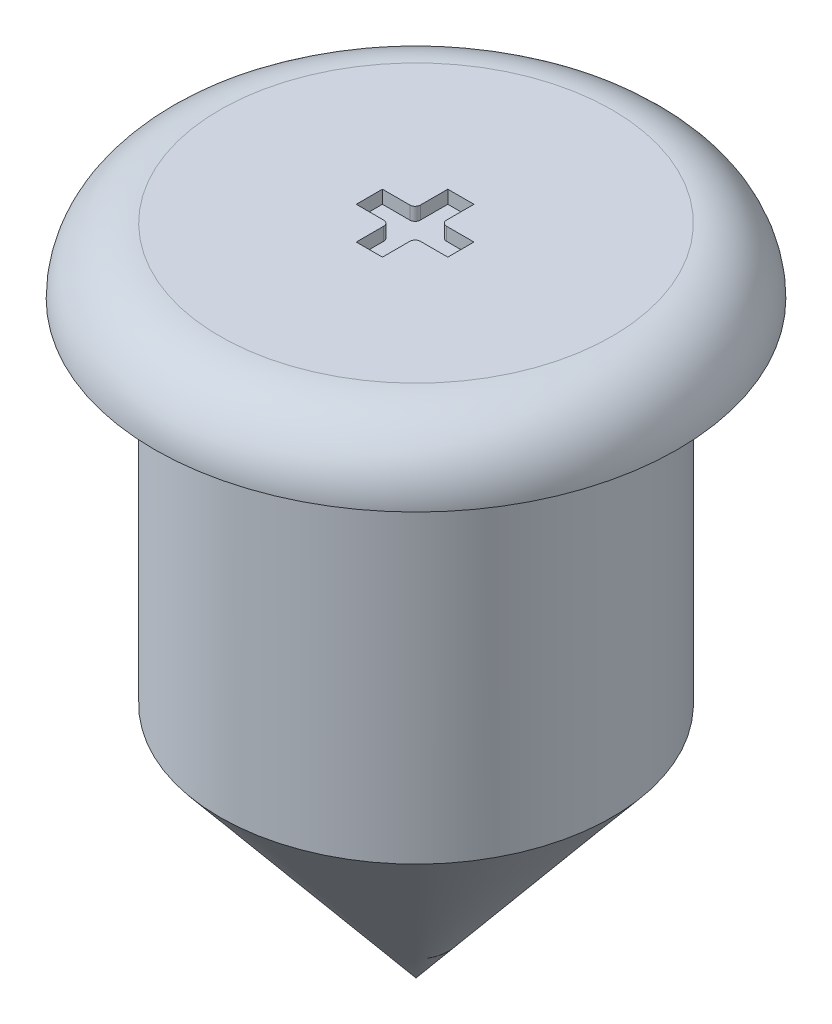
ISO-10303-21;
HEADER;
FILE_DESCRIPTION(('STEP AP214'),'2;1');
FILE_NAME('part.step','',(''),(''),'','','');
FILE_SCHEMA(('AUTOMOTIVE_DESIGN { 1 0 10303 214 1 1 1 1 }'));
ENDSEC;
DATA;
#1=APPLICATION_CONTEXT('core data for automotive mechanical design processes');
#2=APPLICATION_PROTOCOL_DEFINITION('international standard','automotive_design',2000,#1);
#3=PRODUCT_CONTEXT('',#1,'mechanical');
#4=PRODUCT('Part','Part','',(#3));
#5=PRODUCT_RELATED_PRODUCT_CATEGORY('part','',(#4));
#6=PRODUCT_DEFINITION_FORMATION('','',#4);
#7=PRODUCT_DEFINITION_CONTEXT('part definition',#1,'design');
#8=PRODUCT_DEFINITION('design','',#6,#7);
#9=PRODUCT_DEFINITION_SHAPE('','',#8);
#10=(LENGTH_UNIT() NAMED_UNIT(*) SI_UNIT(.MILLI.,.METRE.));
#11=(NAMED_UNIT(*) PLANE_ANGLE_UNIT() SI_UNIT($,.RADIAN.));
#12=(NAMED_UNIT(*) SI_UNIT($,.STERADIAN.) SOLID_ANGLE_UNIT());
#13=UNCERTAINTY_MEASURE_WITH_UNIT(LENGTH_MEASURE(1.E-05),#10,'distance_accuracy_value','');
#14=(GEOMETRIC_REPRESENTATION_CONTEXT(3) GLOBAL_UNCERTAINTY_ASSIGNED_CONTEXT((#13)) GLOBAL_UNIT_ASSIGNED_CONTEXT((#10,
#11,#12)) REPRESENTATION_CONTEXT('',''));
#15=CARTESIAN_POINT('',(0.,0.,0.));
#16=DIRECTION('',(0.,0.,1.));
#17=DIRECTION('',(1.,0.,0.));
#18=AXIS2_PLACEMENT_3D('',#15,#16,#17);
#19=CARTESIAN_POINT('',(0.,-33.8273670127026,0.));
#20=DIRECTION('',(0.,1.,0.));
#21=DIRECTION('',(0.,0.,1.));
#22=AXIS2_PLACEMENT_3D('',#19,#20,#21);
#23=CONICAL_SURFACE('',#22,0.,0.690836574437908);
#24=CARTESIAN_POINT('',(0.,-32.0130195359699,0.));
#25=DIRECTION('',(0.,-1.,0.));
#26=DIRECTION('',(0.,0.,-1.));
#27=AXIS2_PLACEMENT_3D('',#24,#25,#26);
#28=CIRCLE('',#27,1.5);
#29=CARTESIAN_POINT('',(0.,-32.0130195359699,-1.5));
#30=VERTEX_POINT('',#29);
#31=EDGE_CURVE('E11',#30,#30,#28,.T.);
#32=ORIENTED_EDGE('',*,*,#31,.T.);
#33=EDGE_LOOP('',(#32));
#34=FACE_BOUND('',#33,.T.);
#35=CARTESIAN_POINT('',(0.,-33.8273670127026,0.));
#36=VERTEX_POINT('',#35);
#37=VERTEX_LOOP('',#36);
#38=FACE_BOUND('',#37,.T.);
#39=ADVANCED_FACE('F45',(#34,#38),#23,.T.);
#40=CARTESIAN_POINT('',(0.,-33.8273670127026,0.));
#41=DIRECTION('',(0.,-1.,0.));
#42=DIRECTION('',(0.,0.,-1.));
#43=AXIS2_PLACEMENT_3D('',#40,#41,#42);
#44=CYLINDRICAL_SURFACE('',#43,1.5);
#45=CARTESIAN_POINT('',(0.,-29.3273670127026,0.));
#46=DIRECTION('',(0.,-1.,0.));
#47=DIRECTION('',(0.,0.,-1.));
#48=AXIS2_PLACEMENT_3D('',#45,#46,#47);
#49=CIRCLE('',#48,1.5);
#50=CARTESIAN_POINT('',(0.,-29.3273670127026,-1.5));
#51=VERTEX_POINT('',#50);
#52=EDGE_CURVE('E52',#51,#51,#49,.T.);
#53=ORIENTED_EDGE('',*,*,#52,.T.);
#54=EDGE_LOOP('',(#53));
#55=FACE_BOUND('',#54,.T.);
#56=ORIENTED_EDGE('',*,*,#31,.F.);
#57=EDGE_LOOP('',(#56));
#58=FACE_BOUND('',#57,.T.);
#59=ADVANCED_FACE('F299',(#55,#58),#44,.T.);
#60=CARTESIAN_POINT('',(1.5,-29.3273670127026,0.));
#61=DIRECTION('',(0.,-1.,0.));
#62=DIRECTION('',(0.,0.,-1.));
#63=AXIS2_PLACEMENT_3D('',#60,#61,#62);
#64=PLANE('',#63);
#65=CARTESIAN_POINT('',(0.,-29.3273670127026,0.));
#66=DIRECTION('',(0.,-1.,0.));
#67=DIRECTION('',(0.,0.,-1.));
#68=AXIS2_PLACEMENT_3D('',#65,#66,#67);
#69=CIRCLE('',#68,2.);
#70=CARTESIAN_POINT('',(0.,-29.3273670127026,-2.));
#71=VERTEX_POINT('',#70);
#72=EDGE_CURVE('E294',#71,#71,#69,.T.);
#73=ORIENTED_EDGE('',*,*,#72,.T.);
#74=EDGE_LOOP('',(#73));
#75=FACE_BOUND('',#74,.T.);
#76=ORIENTED_EDGE('',*,*,#52,.F.);
#77=EDGE_LOOP('',(#76));
#78=FACE_BOUND('',#77,.T.);
#79=ADVANCED_FACE('F302',(#75,#78),#64,.T.);
#80=CARTESIAN_POINT('',(0.,-29.3273670127026,0.));
#81=DIRECTION('',(0.,-1.,0.));
#82=DIRECTION('',(0.,0.,-1.));
#83=AXIS2_PLACEMENT_3D('',#80,#81,#82);
#84=TOROIDAL_SURFACE('',#83,1.5,0.5);
#85=CARTESIAN_POINT('',(0.,-28.8273670127026,0.));
#86=DIRECTION('',(0.,-1.,0.));
#87=DIRECTION('',(0.,0.,-1.));
#88=AXIS2_PLACEMENT_3D('',#85,#86,#87);
#89=CIRCLE('',#88,1.5);
#90=CARTESIAN_POINT('',(0.,-28.8273670127026,-1.5));
#91=VERTEX_POINT('',#90);
#92=EDGE_CURVE('E264',#91,#91,#89,.T.);
#93=ORIENTED_EDGE('',*,*,#92,.T.);
#94=EDGE_LOOP('',(#93));
#95=FACE_BOUND('',#94,.T.);
#96=ORIENTED_EDGE('',*,*,#72,.F.);
#97=EDGE_LOOP('',(#96));
#98=FACE_BOUND('',#97,.T.);
#99=ADVANCED_FACE('F304',(#95,#98),#84,.T.);
#100=CARTESIAN_POINT('',(1.5,-28.8273670127026,0.));
#101=DIRECTION('',(0.,1.,0.));
#102=DIRECTION('',(0.,0.,1.));
#103=AXIS2_PLACEMENT_3D('',#100,#101,#102);
#104=PLANE('',#103);
#105=DIRECTION('',(0.,0.,-1.));
#106=VECTOR('',#105,1.);
#107=CARTESIAN_POINT('',(0.097259553132017,-28.8273670127026,-0.345923697626217));
#108=LINE('',#107,#106);
#109=CARTESIAN_POINT('',(0.097259553132017,-28.8273670127026,-0.135923697626217));
#110=VERTEX_POINT('',#109);
#111=CARTESIAN_POINT('',(0.0972595531320171,-28.8273670127026,-0.345923697626217));
#112=VERTEX_POINT('',#111);
#113=EDGE_CURVE('E59',#110,#112,#108,.T.);
#114=ORIENTED_EDGE('',*,*,#113,.F.);
#115=CARTESIAN_POINT('',(0.137259553132017,-28.8273670127026,-0.135923697626217));
#116=DIRECTION('',(0.,-1.,0.));
#117=DIRECTION('',(0.,0.,1.));
#118=AXIS2_PLACEMENT_3D('',#115,#116,#117);
#119=CIRCLE('',#118,0.04);
#120=CARTESIAN_POINT('',(0.137259553132017,-28.8273670127026,-0.0959236976262174));
#121=VERTEX_POINT('',#120);
#122=EDGE_CURVE('E178',#121,#110,#119,.T.);
#123=ORIENTED_EDGE('',*,*,#122,.F.);
#124=DIRECTION('',(-1.,0.,0.));
#125=VECTOR('',#124,1.);
#126=CARTESIAN_POINT('',(0.137259553132017,-28.8273670127026,-0.0959236976262174));
#127=LINE('',#126,#125);
#128=CARTESIAN_POINT('',(0.347259553132017,-28.8273670127026,-0.0959236976262174));
#129=VERTEX_POINT('',#128);
#130=EDGE_CURVE('E181',#129,#121,#127,.T.);
#131=ORIENTED_EDGE('',*,*,#130,.F.);
#132=DIRECTION('',(0.,0.,-1.));
#133=VECTOR('',#132,1.);
#134=CARTESIAN_POINT('',(0.347259553132017,-28.8273670127026,-0.0959236976262174));
#135=LINE('',#134,#133);
#136=CARTESIAN_POINT('',(0.347259553132017,-28.8273670127026,0.104076302373783));
#137=VERTEX_POINT('',#136);
#138=EDGE_CURVE('E257',#137,#129,#135,.T.);
#139=ORIENTED_EDGE('',*,*,#138,.F.);
#140=DIRECTION('',(1.,0.,0.));
#141=VECTOR('',#140,1.);
#142=CARTESIAN_POINT('',(0.347259553132017,-28.8273670127026,0.104076302373783));
#143=LINE('',#142,#141);
#144=CARTESIAN_POINT('',(0.137259553132017,-28.8273670127026,0.104076302373783));
#145=VERTEX_POINT('',#144);
#146=EDGE_CURVE('E254',#145,#137,#143,.T.);
#147=ORIENTED_EDGE('',*,*,#146,.F.);
#148=CARTESIAN_POINT('',(0.137259553132017,-28.8273670127026,0.144076302373783));
#149=DIRECTION('',(0.,-1.,0.));
#150=DIRECTION('',(0.,0.,1.));
#151=AXIS2_PLACEMENT_3D('',#148,#149,#150);
#152=CIRCLE('',#151,0.04);
#153=CARTESIAN_POINT('',(0.097259553132017,-28.8273670127026,0.144076302373783));
#154=VERTEX_POINT('',#153);
#155=EDGE_CURVE('E251',#154,#145,#152,.T.);
#156=ORIENTED_EDGE('',*,*,#155,.F.);
#157=DIRECTION('',(0.,0.,-1.));
#158=VECTOR('',#157,1.);
#159=CARTESIAN_POINT('',(0.097259553132017,-28.8273670127026,0.144076302373783));
#160=LINE('',#159,#158);
#161=CARTESIAN_POINT('',(0.097259553132017,-28.8273670127026,0.354076302373785));
#162=VERTEX_POINT('',#161);
#163=EDGE_CURVE('E248',#162,#154,#160,.T.);
#164=ORIENTED_EDGE('',*,*,#163,.F.);
#165=DIRECTION('',(1.,0.,0.));
#166=VECTOR('',#165,1.);
#167=CARTESIAN_POINT('',(0.097259553132017,-28.8273670127026,0.354076302373785));
#168=LINE('',#167,#166);
#169=CARTESIAN_POINT('',(-0.102740446867983,-28.8273670127026,0.354076302373785));
#170=VERTEX_POINT('',#169);
#171=EDGE_CURVE('E245',#170,#162,#168,.T.);
#172=ORIENTED_EDGE('',*,*,#171,.F.);
#173=DIRECTION('',(0.,0.,1.));
#174=VECTOR('',#173,1.);
#175=CARTESIAN_POINT('',(-0.102740446867983,-28.8273670127026,0.144076302373783));
#176=LINE('',#175,#174);
#177=CARTESIAN_POINT('',(-0.102740446867983,-28.8273670127026,0.144076302373783));
#178=VERTEX_POINT('',#177);
#179=EDGE_CURVE('E242',#178,#170,#176,.T.);
#180=ORIENTED_EDGE('',*,*,#179,.F.);
#181=CARTESIAN_POINT('',(-0.142740446867983,-28.8273670127026,0.144076302373783));
#182=DIRECTION('',(0.,-1.,0.));
#183=DIRECTION('',(0.,0.,-1.));
#184=AXIS2_PLACEMENT_3D('',#181,#182,#183);
#185=CIRCLE('',#184,0.04);
#186=CARTESIAN_POINT('',(-0.142740446867983,-28.8273670127026,0.104076302373783));
#187=VERTEX_POINT('',#186);
#188=EDGE_CURVE('E239',#187,#178,#185,.T.);
#189=ORIENTED_EDGE('',*,*,#188,.F.);
#190=DIRECTION('',(1.,0.,0.));
#191=VECTOR('',#190,1.);
#192=CARTESIAN_POINT('',(-0.352740446867983,-28.8273670127026,0.104076302373783));
#193=LINE('',#192,#191);
#194=CARTESIAN_POINT('',(-0.352740446867983,-28.8273670127026,0.104076302373783));
#195=VERTEX_POINT('',#194);
#196=EDGE_CURVE('E236',#195,#187,#193,.T.);
#197=ORIENTED_EDGE('',*,*,#196,.F.);
#198=DIRECTION('',(0.,0.,1.));
#199=VECTOR('',#198,1.);
#200=CARTESIAN_POINT('',(-0.352740446867983,-28.8273670127026,-0.0959236976262174));
#201=LINE('',#200,#199);
#202=CARTESIAN_POINT('',(-0.352740446867983,-28.8273670127026,-0.0959236976262174));
#203=VERTEX_POINT('',#202);
#204=EDGE_CURVE('E233',#203,#195,#201,.T.);
#205=ORIENTED_EDGE('',*,*,#204,.F.);
#206=DIRECTION('',(-1.,0.,0.));
#207=VECTOR('',#206,1.);
#208=CARTESIAN_POINT('',(-0.142740446867983,-28.8273670127026,-0.0959236976262174));
#209=LINE('',#208,#207);
#210=CARTESIAN_POINT('',(-0.142740446867983,-28.8273670127026,-0.0959236976262174));
#211=VERTEX_POINT('',#210);
#212=EDGE_CURVE('E230',#211,#203,#209,.T.);
#213=ORIENTED_EDGE('',*,*,#212,.F.);
#214=CARTESIAN_POINT('',(-0.142740446867983,-28.8273670127026,-0.135923697626217));
#215=DIRECTION('',(0.,-1.,0.));
#216=DIRECTION('',(0.,0.,-1.));
#217=AXIS2_PLACEMENT_3D('',#214,#215,#216);
#218=CIRCLE('',#217,0.04);
#219=CARTESIAN_POINT('',(-0.102740446867983,-28.8273670127026,-0.135923697626217));
#220=VERTEX_POINT('',#219);
#221=EDGE_CURVE('E227',#220,#211,#218,.T.);
#222=ORIENTED_EDGE('',*,*,#221,.F.);
#223=DIRECTION('',(0.,0.,1.));
#224=VECTOR('',#223,1.);
#225=CARTESIAN_POINT('',(-0.102740446867983,-28.8273670127026,-0.345923697626217));
#226=LINE('',#225,#224);
#227=CARTESIAN_POINT('',(-0.102740446867983,-28.8273670127026,-0.345923697626217));
#228=VERTEX_POINT('',#227);
#229=EDGE_CURVE('E224',#228,#220,#226,.T.);
#230=ORIENTED_EDGE('',*,*,#229,.F.);
#231=DIRECTION('',(-1.,0.,0.));
#232=VECTOR('',#231,1.);
#233=CARTESIAN_POINT('',(-0.102740446867983,-28.8273670127026,-0.345923697626217));
#234=LINE('',#233,#232);
#235=EDGE_CURVE('E222',#112,#228,#234,.T.);
#236=ORIENTED_EDGE('',*,*,#235,.F.);
#237=EDGE_LOOP('',(#114,#123,#131,#139,#147,#156,#164,#172,#180,#189,#197,#205,#213,#222,#230,#236));
#238=FACE_BOUND('',#237,.T.);
#239=ORIENTED_EDGE('',*,*,#92,.F.);
#240=EDGE_LOOP('',(#239));
#241=FACE_BOUND('',#240,.T.);
#242=ADVANCED_FACE('F311',(#238,#241),#104,.T.);
#243=CARTESIAN_POINT('',(0.097259553132017,-28.9273670127026,-0.345923697626217));
#244=DIRECTION('',(1.,0.,0.));
#245=DIRECTION('',(0.,0.,-1.));
#246=AXIS2_PLACEMENT_3D('',#243,#244,#245);
#247=PLANE('',#246);
#248=ORIENTED_EDGE('',*,*,#113,.T.);
#249=DIRECTION('',(0.,1.,0.));
#250=VECTOR('',#249,1.);
#251=CARTESIAN_POINT('',(0.097259553132017,-28.9273670127026,-0.345923697626217));
#252=LINE('',#251,#250);
#253=CARTESIAN_POINT('',(0.097259553132017,-28.9273670127026,-0.345923697626217));
#254=VERTEX_POINT('',#253);
#255=EDGE_CURVE('E155',#254,#112,#252,.T.);
#256=ORIENTED_EDGE('',*,*,#255,.F.);
#257=DIRECTION('',(0.,0.,-1.));
#258=VECTOR('',#257,1.);
#259=CARTESIAN_POINT('',(0.097259553132017,-28.9273670127026,-0.345923697626217));
#260=LINE('',#259,#258);
#261=CARTESIAN_POINT('',(0.097259553132017,-28.9273670127026,-0.135923697626217));
#262=VERTEX_POINT('',#261);
#263=EDGE_CURVE('E159',#262,#254,#260,.T.);
#264=ORIENTED_EDGE('',*,*,#263,.F.);
#265=DIRECTION('',(0.,1.,0.));
#266=VECTOR('',#265,1.);
#267=CARTESIAN_POINT('',(0.097259553132017,-28.9273670127026,-0.135923697626217));
#268=LINE('',#267,#266);
#269=EDGE_CURVE('E262',#262,#110,#268,.T.);
#270=ORIENTED_EDGE('',*,*,#269,.T.);
#271=EDGE_LOOP('',(#248,#256,#264,#270));
#272=FACE_BOUND('',#271,.T.);
#273=ADVANCED_FACE('F157',(#272),#247,.F.);
#274=CARTESIAN_POINT('',(0.137259553132017,-28.9273670127026,-0.135923697626217));
#275=DIRECTION('',(0.,1.,0.));
#276=DIRECTION('',(0.,0.,1.));
#277=AXIS2_PLACEMENT_3D('',#274,#275,#276);
#278=CYLINDRICAL_SURFACE('',#277,0.04);
#279=ORIENTED_EDGE('',*,*,#122,.T.);
#280=ORIENTED_EDGE('',*,*,#269,.F.);
#281=CARTESIAN_POINT('',(0.137259553132017,-28.9273670127026,-0.135923697626217));
#282=DIRECTION('',(0.,-1.,0.));
#283=DIRECTION('',(0.,0.,1.));
#284=AXIS2_PLACEMENT_3D('',#281,#282,#283);
#285=CIRCLE('',#284,0.04);
#286=CARTESIAN_POINT('',(0.137259553132017,-28.9273670127026,-0.0959236976262174));
#287=VERTEX_POINT('',#286);
#288=EDGE_CURVE('E165',#287,#262,#285,.T.);
#289=ORIENTED_EDGE('',*,*,#288,.F.);
#290=DIRECTION('',(0.,1.,0.));
#291=VECTOR('',#290,1.);
#292=CARTESIAN_POINT('',(0.137259553132017,-28.9273670127026,-0.0959236976262174));
#293=LINE('',#292,#291);
#294=EDGE_CURVE('E265',#287,#121,#293,.T.);
#295=ORIENTED_EDGE('',*,*,#294,.T.);
#296=EDGE_LOOP('',(#279,#280,#289,#295));
#297=FACE_BOUND('',#296,.T.);
#298=ADVANCED_FACE('F363',(#297),#278,.T.);
#299=CARTESIAN_POINT('',(0.137259553132017,-28.9273670127026,-0.0959236976262174));
#300=DIRECTION('',(0.,0.,-1.));
#301=DIRECTION('',(-1.,0.,0.));
#302=AXIS2_PLACEMENT_3D('',#299,#300,#301);
#303=PLANE('',#302);
#304=ORIENTED_EDGE('',*,*,#130,.T.);
#305=ORIENTED_EDGE('',*,*,#294,.F.);
#306=DIRECTION('',(-1.,0.,0.));
#307=VECTOR('',#306,1.);
#308=CARTESIAN_POINT('',(0.137259553132017,-28.9273670127026,-0.0959236976262174));
#309=LINE('',#308,#307);
#310=CARTESIAN_POINT('',(0.347259553132017,-28.9273670127026,-0.0959236976262174));
#311=VERTEX_POINT('',#310);
#312=EDGE_CURVE('E218',#311,#287,#309,.T.);
#313=ORIENTED_EDGE('',*,*,#312,.F.);
#314=DIRECTION('',(0.,1.,0.));
#315=VECTOR('',#314,1.);
#316=CARTESIAN_POINT('',(0.347259553132017,-28.9273670127026,-0.0959236976262174));
#317=LINE('',#316,#315);
#318=EDGE_CURVE('E267',#311,#129,#317,.T.);
#319=ORIENTED_EDGE('',*,*,#318,.T.);
#320=EDGE_LOOP('',(#304,#305,#313,#319));
#321=FACE_BOUND('',#320,.T.);
#322=ADVANCED_FACE('F373',(#321),#303,.F.);
#323=CARTESIAN_POINT('',(0.347259553132017,-28.9273670127026,-0.0959236976262174));
#324=DIRECTION('',(1.,0.,0.));
#325=DIRECTION('',(0.,0.,-1.));
#326=AXIS2_PLACEMENT_3D('',#323,#324,#325);
#327=PLANE('',#326);
#328=ORIENTED_EDGE('',*,*,#138,.T.);
#329=ORIENTED_EDGE('',*,*,#318,.F.);
#330=DIRECTION('',(0.,0.,-1.));
#331=VECTOR('',#330,1.);
#332=CARTESIAN_POINT('',(0.347259553132017,-28.9273670127026,-0.0959236976262174));
#333=LINE('',#332,#331);
#334=CARTESIAN_POINT('',(0.347259553132017,-28.9273670127026,0.104076302373783));
#335=VERTEX_POINT('',#334);
#336=EDGE_CURVE('E215',#335,#311,#333,.T.);
#337=ORIENTED_EDGE('',*,*,#336,.F.);
#338=DIRECTION('',(0.,1.,0.));
#339=VECTOR('',#338,1.);
#340=CARTESIAN_POINT('',(0.347259553132017,-28.9273670127026,0.104076302373783));
#341=LINE('',#340,#339);
#342=EDGE_CURVE('E269',#335,#137,#341,.T.);
#343=ORIENTED_EDGE('',*,*,#342,.T.);
#344=EDGE_LOOP('',(#328,#329,#337,#343));
#345=FACE_BOUND('',#344,.T.);
#346=ADVANCED_FACE('F384',(#345),#327,.F.);
#347=CARTESIAN_POINT('',(0.347259553132017,-28.9273670127026,0.104076302373783));
#348=DIRECTION('',(0.,0.,1.));
#349=DIRECTION('',(1.,0.,0.));
#350=AXIS2_PLACEMENT_3D('',#347,#348,#349);
#351=PLANE('',#350);
#352=ORIENTED_EDGE('',*,*,#146,.T.);
#353=ORIENTED_EDGE('',*,*,#342,.F.);
#354=DIRECTION('',(1.,0.,0.));
#355=VECTOR('',#354,1.);
#356=CARTESIAN_POINT('',(0.347259553132017,-28.9273670127026,0.104076302373783));
#357=LINE('',#356,#355);
#358=CARTESIAN_POINT('',(0.137259553132017,-28.9273670127026,0.104076302373783));
#359=VERTEX_POINT('',#358);
#360=EDGE_CURVE('E212',#359,#335,#357,.T.);
#361=ORIENTED_EDGE('',*,*,#360,.F.);
#362=DIRECTION('',(0.,1.,0.));
#363=VECTOR('',#362,1.);
#364=CARTESIAN_POINT('',(0.137259553132017,-28.9273670127026,0.104076302373783));
#365=LINE('',#364,#363);
#366=EDGE_CURVE('E271',#359,#145,#365,.T.);
#367=ORIENTED_EDGE('',*,*,#366,.T.);
#368=EDGE_LOOP('',(#352,#353,#361,#367));
#369=FACE_BOUND('',#368,.T.);
#370=ADVANCED_FACE('F395',(#369),#351,.F.);
#371=CARTESIAN_POINT('',(0.137259553132017,-28.9273670127026,0.144076302373783));
#372=DIRECTION('',(0.,1.,0.));
#373=DIRECTION('',(0.,0.,1.));
#374=AXIS2_PLACEMENT_3D('',#371,#372,#373);
#375=CYLINDRICAL_SURFACE('',#374,0.04);
#376=ORIENTED_EDGE('',*,*,#155,.T.);
#377=ORIENTED_EDGE('',*,*,#366,.F.);
#378=CARTESIAN_POINT('',(0.137259553132017,-28.9273670127026,0.144076302373783));
#379=DIRECTION('',(0.,-1.,0.));
#380=DIRECTION('',(0.,0.,1.));
#381=AXIS2_PLACEMENT_3D('',#378,#379,#380);
#382=CIRCLE('',#381,0.04);
#383=CARTESIAN_POINT('',(0.097259553132017,-28.9273670127026,0.144076302373783));
#384=VERTEX_POINT('',#383);
#385=EDGE_CURVE('E209',#384,#359,#382,.T.);
#386=ORIENTED_EDGE('',*,*,#385,.F.);
#387=DIRECTION('',(0.,1.,0.));
#388=VECTOR('',#387,1.);
#389=CARTESIAN_POINT('',(0.097259553132017,-28.9273670127026,0.144076302373783));
#390=LINE('',#389,#388);
#391=EDGE_CURVE('E273',#384,#154,#390,.T.);
#392=ORIENTED_EDGE('',*,*,#391,.T.);
#393=EDGE_LOOP('',(#376,#377,#386,#392));
#394=FACE_BOUND('',#393,.T.);
#395=ADVANCED_FACE('F406',(#394),#375,.T.);
#396=CARTESIAN_POINT('',(0.097259553132017,-28.9273670127026,0.144076302373783));
#397=DIRECTION('',(1.,0.,0.));
#398=DIRECTION('',(0.,0.,-1.));
#399=AXIS2_PLACEMENT_3D('',#396,#397,#398);
#400=PLANE('',#399);
#401=ORIENTED_EDGE('',*,*,#163,.T.);
#402=ORIENTED_EDGE('',*,*,#391,.F.);
#403=DIRECTION('',(0.,0.,-1.));
#404=VECTOR('',#403,1.);
#405=CARTESIAN_POINT('',(0.097259553132017,-28.9273670127026,0.144076302373783));
#406=LINE('',#405,#404);
#407=CARTESIAN_POINT('',(0.097259553132017,-28.9273670127026,0.354076302373785));
#408=VERTEX_POINT('',#407);
#409=EDGE_CURVE('E206',#408,#384,#406,.T.);
#410=ORIENTED_EDGE('',*,*,#409,.F.);
#411=DIRECTION('',(0.,1.,0.));
#412=VECTOR('',#411,1.);
#413=CARTESIAN_POINT('',(0.097259553132017,-28.9273670127026,0.354076302373785));
#414=LINE('',#413,#412);
#415=EDGE_CURVE('E275',#408,#162,#414,.T.);
#416=ORIENTED_EDGE('',*,*,#415,.T.);
#417=EDGE_LOOP('',(#401,#402,#410,#416));
#418=FACE_BOUND('',#417,.T.);
#419=ADVANCED_FACE('F417',(#418),#400,.F.);
#420=CARTESIAN_POINT('',(0.097259553132017,-28.9273670127026,0.354076302373785));
#421=DIRECTION('',(0.,0.,1.));
#422=DIRECTION('',(1.,0.,0.));
#423=AXIS2_PLACEMENT_3D('',#420,#421,#422);
#424=PLANE('',#423);
#425=ORIENTED_EDGE('',*,*,#171,.T.);
#426=ORIENTED_EDGE('',*,*,#415,.F.);
#427=DIRECTION('',(1.,0.,0.));
#428=VECTOR('',#427,1.);
#429=CARTESIAN_POINT('',(0.097259553132017,-28.9273670127026,0.354076302373785));
#430=LINE('',#429,#428);
#431=CARTESIAN_POINT('',(-0.102740446867983,-28.9273670127026,0.354076302373785));
#432=VERTEX_POINT('',#431);
#433=EDGE_CURVE('E203',#432,#408,#430,.T.);
#434=ORIENTED_EDGE('',*,*,#433,.F.);
#435=DIRECTION('',(0.,1.,0.));
#436=VECTOR('',#435,1.);
#437=CARTESIAN_POINT('',(-0.102740446867983,-28.9273670127026,0.354076302373785));
#438=LINE('',#437,#436);
#439=EDGE_CURVE('E277',#432,#170,#438,.T.);
#440=ORIENTED_EDGE('',*,*,#439,.T.);
#441=EDGE_LOOP('',(#425,#426,#434,#440));
#442=FACE_BOUND('',#441,.T.);
#443=ADVANCED_FACE('F428',(#442),#424,.F.);
#444=CARTESIAN_POINT('',(-0.102740446867983,-28.9273670127026,0.144076302373783));
#445=DIRECTION('',(-1.,0.,0.));
#446=DIRECTION('',(0.,0.,1.));
#447=AXIS2_PLACEMENT_3D('',#444,#445,#446);
#448=PLANE('',#447);
#449=ORIENTED_EDGE('',*,*,#179,.T.);
#450=ORIENTED_EDGE('',*,*,#439,.F.);
#451=DIRECTION('',(0.,0.,1.));
#452=VECTOR('',#451,1.);
#453=CARTESIAN_POINT('',(-0.102740446867983,-28.9273670127026,0.144076302373783));
#454=LINE('',#453,#452);
#455=CARTESIAN_POINT('',(-0.102740446867983,-28.9273670127026,0.144076302373783));
#456=VERTEX_POINT('',#455);
#457=EDGE_CURVE('E200',#456,#432,#454,.T.);
#458=ORIENTED_EDGE('',*,*,#457,.F.);
#459=DIRECTION('',(0.,1.,0.));
#460=VECTOR('',#459,1.);
#461=CARTESIAN_POINT('',(-0.102740446867983,-28.9273670127026,0.144076302373783));
#462=LINE('',#461,#460);
#463=EDGE_CURVE('E279',#456,#178,#462,.T.);
#464=ORIENTED_EDGE('',*,*,#463,.T.);
#465=EDGE_LOOP('',(#449,#450,#458,#464));
#466=FACE_BOUND('',#465,.T.);
#467=ADVANCED_FACE('F439',(#466),#448,.F.);
#468=CARTESIAN_POINT('',(-0.142740446867983,-28.9273670127026,0.144076302373783));
#469=DIRECTION('',(0.,1.,0.));
#470=DIRECTION('',(0.,0.,1.));
#471=AXIS2_PLACEMENT_3D('',#468,#469,#470);
#472=CYLINDRICAL_SURFACE('',#471,0.04);
#473=ORIENTED_EDGE('',*,*,#188,.T.);
#474=ORIENTED_EDGE('',*,*,#463,.F.);
#475=CARTESIAN_POINT('',(-0.142740446867983,-28.9273670127026,0.144076302373783));
#476=DIRECTION('',(0.,-1.,0.));
#477=DIRECTION('',(0.,0.,-1.));
#478=AXIS2_PLACEMENT_3D('',#475,#476,#477);
#479=CIRCLE('',#478,0.04);
#480=CARTESIAN_POINT('',(-0.142740446867983,-28.9273670127026,0.104076302373783));
#481=VERTEX_POINT('',#480);
#482=EDGE_CURVE('E197',#481,#456,#479,.T.);
#483=ORIENTED_EDGE('',*,*,#482,.F.);
#484=DIRECTION('',(0.,1.,0.));
#485=VECTOR('',#484,1.);
#486=CARTESIAN_POINT('',(-0.142740446867983,-28.9273670127026,0.104076302373783));
#487=LINE('',#486,#485);
#488=EDGE_CURVE('E281',#481,#187,#487,.T.);
#489=ORIENTED_EDGE('',*,*,#488,.T.);
#490=EDGE_LOOP('',(#473,#474,#483,#489));
#491=FACE_BOUND('',#490,.T.);
#492=ADVANCED_FACE('F450',(#491),#472,.T.);
#493=CARTESIAN_POINT('',(-0.352740446867983,-28.9273670127026,0.104076302373783));
#494=DIRECTION('',(0.,0.,1.));
#495=DIRECTION('',(1.,0.,0.));
#496=AXIS2_PLACEMENT_3D('',#493,#494,#495);
#497=PLANE('',#496);
#498=ORIENTED_EDGE('',*,*,#196,.T.);
#499=ORIENTED_EDGE('',*,*,#488,.F.);
#500=DIRECTION('',(1.,0.,0.));
#501=VECTOR('',#500,1.);
#502=CARTESIAN_POINT('',(-0.352740446867983,-28.9273670127026,0.104076302373783));
#503=LINE('',#502,#501);
#504=CARTESIAN_POINT('',(-0.352740446867983,-28.9273670127026,0.104076302373783));
#505=VERTEX_POINT('',#504);
#506=EDGE_CURVE('E194',#505,#481,#503,.T.);
#507=ORIENTED_EDGE('',*,*,#506,.F.);
#508=DIRECTION('',(0.,1.,0.));
#509=VECTOR('',#508,1.);
#510=CARTESIAN_POINT('',(-0.352740446867983,-28.9273670127026,0.104076302373783));
#511=LINE('',#510,#509);
#512=EDGE_CURVE('E283',#505,#195,#511,.T.);
#513=ORIENTED_EDGE('',*,*,#512,.T.);
#514=EDGE_LOOP('',(#498,#499,#507,#513));
#515=FACE_BOUND('',#514,.T.);
#516=ADVANCED_FACE('F461',(#515),#497,.F.);
#517=CARTESIAN_POINT('',(-0.352740446867983,-28.9273670127026,-0.0959236976262174));
#518=DIRECTION('',(-1.,0.,0.));
#519=DIRECTION('',(0.,0.,1.));
#520=AXIS2_PLACEMENT_3D('',#517,#518,#519);
#521=PLANE('',#520);
#522=ORIENTED_EDGE('',*,*,#204,.T.);
#523=ORIENTED_EDGE('',*,*,#512,.F.);
#524=DIRECTION('',(0.,0.,1.));
#525=VECTOR('',#524,1.);
#526=CARTESIAN_POINT('',(-0.352740446867983,-28.9273670127026,-0.0959236976262174));
#527=LINE('',#526,#525);
#528=CARTESIAN_POINT('',(-0.352740446867983,-28.9273670127026,-0.0959236976262174));
#529=VERTEX_POINT('',#528);
#530=EDGE_CURVE('E191',#529,#505,#527,.T.);
#531=ORIENTED_EDGE('',*,*,#530,.F.);
#532=DIRECTION('',(0.,1.,0.));
#533=VECTOR('',#532,1.);
#534=CARTESIAN_POINT('',(-0.352740446867983,-28.9273670127026,-0.0959236976262174));
#535=LINE('',#534,#533);
#536=EDGE_CURVE('E285',#529,#203,#535,.T.);
#537=ORIENTED_EDGE('',*,*,#536,.T.);
#538=EDGE_LOOP('',(#522,#523,#531,#537));
#539=FACE_BOUND('',#538,.T.);
#540=ADVANCED_FACE('F472',(#539),#521,.F.);
#541=CARTESIAN_POINT('',(-0.142740446867983,-28.9273670127026,-0.0959236976262174));
#542=DIRECTION('',(0.,0.,-1.));
#543=DIRECTION('',(-1.,0.,0.));
#544=AXIS2_PLACEMENT_3D('',#541,#542,#543);
#545=PLANE('',#544);
#546=ORIENTED_EDGE('',*,*,#212,.T.);
#547=ORIENTED_EDGE('',*,*,#536,.F.);
#548=DIRECTION('',(-1.,0.,0.));
#549=VECTOR('',#548,1.);
#550=CARTESIAN_POINT('',(-0.142740446867983,-28.9273670127026,-0.0959236976262174));
#551=LINE('',#550,#549);
#552=CARTESIAN_POINT('',(-0.142740446867983,-28.9273670127026,-0.0959236976262174));
#553=VERTEX_POINT('',#552);
#554=EDGE_CURVE('E188',#553,#529,#551,.T.);
#555=ORIENTED_EDGE('',*,*,#554,.F.);
#556=DIRECTION('',(0.,1.,0.));
#557=VECTOR('',#556,1.);
#558=CARTESIAN_POINT('',(-0.142740446867983,-28.9273670127026,-0.0959236976262174));
#559=LINE('',#558,#557);
#560=EDGE_CURVE('E287',#553,#211,#559,.T.);
#561=ORIENTED_EDGE('',*,*,#560,.T.);
#562=EDGE_LOOP('',(#546,#547,#555,#561));
#563=FACE_BOUND('',#562,.T.);
#564=ADVANCED_FACE('F483',(#563),#545,.F.);
#565=CARTESIAN_POINT('',(-0.142740446867983,-28.9273670127026,-0.135923697626217));
#566=DIRECTION('',(0.,1.,0.));
#567=DIRECTION('',(0.,0.,1.));
#568=AXIS2_PLACEMENT_3D('',#565,#566,#567);
#569=CYLINDRICAL_SURFACE('',#568,0.04);
#570=ORIENTED_EDGE('',*,*,#221,.T.);
#571=ORIENTED_EDGE('',*,*,#560,.F.);
#572=CARTESIAN_POINT('',(-0.142740446867983,-28.9273670127026,-0.135923697626217));
#573=DIRECTION('',(0.,-1.,0.));
#574=DIRECTION('',(0.,0.,-1.));
#575=AXIS2_PLACEMENT_3D('',#572,#573,#574);
#576=CIRCLE('',#575,0.04);
#577=CARTESIAN_POINT('',(-0.102740446867983,-28.9273670127026,-0.135923697626217));
#578=VERTEX_POINT('',#577);
#579=EDGE_CURVE('E185',#578,#553,#576,.T.);
#580=ORIENTED_EDGE('',*,*,#579,.F.);
#581=DIRECTION('',(0.,1.,0.));
#582=VECTOR('',#581,1.);
#583=CARTESIAN_POINT('',(-0.102740446867983,-28.9273670127026,-0.135923697626217));
#584=LINE('',#583,#582);
#585=EDGE_CURVE('E289',#578,#220,#584,.T.);
#586=ORIENTED_EDGE('',*,*,#585,.T.);
#587=EDGE_LOOP('',(#570,#571,#580,#586));
#588=FACE_BOUND('',#587,.T.);
#589=ADVANCED_FACE('F494',(#588),#569,.T.);
#590=CARTESIAN_POINT('',(-0.102740446867983,-28.9273670127026,-0.345923697626217));
#591=DIRECTION('',(-1.,0.,0.));
#592=DIRECTION('',(0.,0.,1.));
#593=AXIS2_PLACEMENT_3D('',#590,#591,#592);
#594=PLANE('',#593);
#595=ORIENTED_EDGE('',*,*,#229,.T.);
#596=ORIENTED_EDGE('',*,*,#585,.F.);
#597=DIRECTION('',(0.,0.,1.));
#598=VECTOR('',#597,1.);
#599=CARTESIAN_POINT('',(-0.102740446867983,-28.9273670127026,-0.345923697626217));
#600=LINE('',#599,#598);
#601=CARTESIAN_POINT('',(-0.102740446867983,-28.9273670127026,-0.345923697626217));
#602=VERTEX_POINT('',#601);
#603=EDGE_CURVE('E173',#602,#578,#600,.T.);
#604=ORIENTED_EDGE('',*,*,#603,.F.);
#605=DIRECTION('',(0.,1.,0.));
#606=VECTOR('',#605,1.);
#607=CARTESIAN_POINT('',(-0.102740446867983,-28.9273670127026,-0.345923697626217));
#608=LINE('',#607,#606);
#609=EDGE_CURVE('E164',#602,#228,#608,.T.);
#610=ORIENTED_EDGE('',*,*,#609,.T.);
#611=EDGE_LOOP('',(#595,#596,#604,#610));
#612=FACE_BOUND('',#611,.T.);
#613=ADVANCED_FACE('F505',(#612),#594,.F.);
#614=CARTESIAN_POINT('',(-0.102740446867983,-28.9273670127026,-0.345923697626217));
#615=DIRECTION('',(0.,0.,-1.));
#616=DIRECTION('',(-1.,0.,0.));
#617=AXIS2_PLACEMENT_3D('',#614,#615,#616);
#618=PLANE('',#617);
#619=ORIENTED_EDGE('',*,*,#235,.T.);
#620=ORIENTED_EDGE('',*,*,#609,.F.);
#621=DIRECTION('',(-1.,0.,0.));
#622=VECTOR('',#621,1.);
#623=CARTESIAN_POINT('',(-0.102740446867983,-28.9273670127026,-0.345923697626217));
#624=LINE('',#623,#622);
#625=EDGE_CURVE('E168',#254,#602,#624,.T.);
#626=ORIENTED_EDGE('',*,*,#625,.F.);
#627=ORIENTED_EDGE('',*,*,#255,.T.);
#628=EDGE_LOOP('',(#619,#620,#626,#627));
#629=FACE_BOUND('',#628,.T.);
#630=ADVANCED_FACE('F169',(#629),#618,.F.);
#631=CARTESIAN_POINT('',(0.137259553132017,-28.9273670127026,-0.135923697626217));
#632=DIRECTION('',(0.,1.,0.));
#633=DIRECTION('',(0.,0.,1.));
#634=AXIS2_PLACEMENT_3D('',#631,#632,#633);
#635=PLANE('',#634);
#636=ORIENTED_EDGE('',*,*,#263,.T.);
#637=ORIENTED_EDGE('',*,*,#625,.T.);
#638=ORIENTED_EDGE('',*,*,#603,.T.);
#639=ORIENTED_EDGE('',*,*,#579,.T.);
#640=ORIENTED_EDGE('',*,*,#554,.T.);
#641=ORIENTED_EDGE('',*,*,#530,.T.);
#642=ORIENTED_EDGE('',*,*,#506,.T.);
#643=ORIENTED_EDGE('',*,*,#482,.T.);
#644=ORIENTED_EDGE('',*,*,#457,.T.);
#645=ORIENTED_EDGE('',*,*,#433,.T.);
#646=ORIENTED_EDGE('',*,*,#409,.T.);
#647=ORIENTED_EDGE('',*,*,#385,.T.);
#648=ORIENTED_EDGE('',*,*,#360,.T.);
#649=ORIENTED_EDGE('',*,*,#336,.T.);
#650=ORIENTED_EDGE('',*,*,#312,.T.);
#651=ORIENTED_EDGE('',*,*,#288,.T.);
#652=EDGE_LOOP('',(#636,#637,#638,#639,#640,#641,#642,#643,#644,#645,#646,#647,#648,#649,#650,#651));
#653=FACE_BOUND('',#652,.T.);
#654=ADVANCED_FACE('F175',(#653),#635,.T.);
#655=CLOSED_SHELL('',(#39,#59,#79,#99,#242,#273,#298,#322,#346,#370,#395,#419,#443,#467,#492,
#516,#540,#564,#589,#613,#630,#654));
#656=MANIFOLD_SOLID_BREP('B2',#655);
#657=ADVANCED_BREP_SHAPE_REPRESENTATION('',(#18,#656),#14);
#658=SHAPE_DEFINITION_REPRESENTATION(#9,#657);
ENDSEC;
END-ISO-10303-21;
